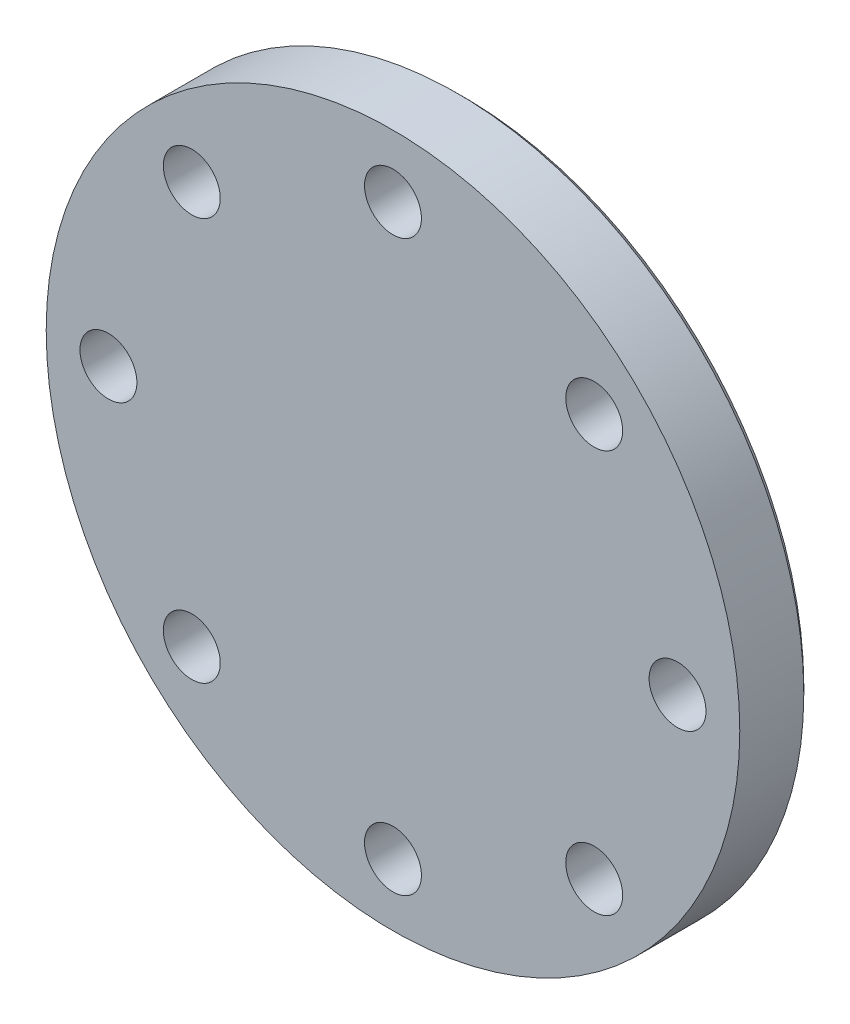
ISO-10303-21;
HEADER;
FILE_DESCRIPTION(('STEP AP214'),'2;1');
FILE_NAME('part.step','',(''),(''),'','','');
FILE_SCHEMA(('AUTOMOTIVE_DESIGN { 1 0 10303 214 1 1 1 1 }'));
ENDSEC;
DATA;
#1=APPLICATION_CONTEXT('core data for automotive mechanical design processes');
#2=APPLICATION_PROTOCOL_DEFINITION('international standard','automotive_design',2000,#1);
#3=PRODUCT_CONTEXT('',#1,'mechanical');
#4=PRODUCT('Part','Part','',(#3));
#5=PRODUCT_RELATED_PRODUCT_CATEGORY('part','',(#4));
#6=PRODUCT_DEFINITION_FORMATION('','',#4);
#7=PRODUCT_DEFINITION_CONTEXT('part definition',#1,'design');
#8=PRODUCT_DEFINITION('design','',#6,#7);
#9=PRODUCT_DEFINITION_SHAPE('','',#8);
#10=(LENGTH_UNIT() NAMED_UNIT(*) SI_UNIT(.MILLI.,.METRE.));
#11=(NAMED_UNIT(*) PLANE_ANGLE_UNIT() SI_UNIT($,.RADIAN.));
#12=(NAMED_UNIT(*) SI_UNIT($,.STERADIAN.) SOLID_ANGLE_UNIT());
#13=UNCERTAINTY_MEASURE_WITH_UNIT(LENGTH_MEASURE(1.E-05),#10,'distance_accuracy_value','');
#14=(GEOMETRIC_REPRESENTATION_CONTEXT(3) GLOBAL_UNCERTAINTY_ASSIGNED_CONTEXT((#13)) GLOBAL_UNIT_ASSIGNED_CONTEXT((#10,
#11,#12)) REPRESENTATION_CONTEXT('',''));
#15=CARTESIAN_POINT('',(0.,0.,0.));
#16=DIRECTION('',(0.,0.,1.));
#17=DIRECTION('',(1.,0.,0.));
#18=AXIS2_PLACEMENT_3D('',#15,#16,#17);
#19=CARTESIAN_POINT('',(3.5,10.85,-17.));
#20=DIRECTION('',(0.,0.,-1.));
#21=DIRECTION('',(-1.,0.,0.));
#22=AXIS2_PLACEMENT_3D('',#19,#20,#21);
#23=PLANE('',#22);
#24=CARTESIAN_POINT('',(5.656854249492,5.656854249492,-17.));
#25=DIRECTION('',(0.,0.,-1.));
#26=DIRECTION('',(-1.,0.,0.));
#27=AXIS2_PLACEMENT_3D('',#24,#25,#26);
#28=CIRCLE('',#27,0.8);
#29=CARTESIAN_POINT('',(4.856854249492,5.656854249492,-17.));
#30=VERTEX_POINT('',#29);
#31=EDGE_CURVE('E37',#30,#30,#28,.T.);
#32=ORIENTED_EDGE('',*,*,#31,.T.);
#33=EDGE_LOOP('',(#32));
#34=FACE_BOUND('',#33,.T.);
#35=CARTESIAN_POINT('',(5.656854249492,-5.656854249492,-17.));
#36=DIRECTION('',(0.,0.,-1.));
#37=DIRECTION('',(-1.,0.,0.));
#38=AXIS2_PLACEMENT_3D('',#35,#36,#37);
#39=CIRCLE('',#38,0.8);
#40=CARTESIAN_POINT('',(4.856854249492,-5.656854249492,-17.));
#41=VERTEX_POINT('',#40);
#42=EDGE_CURVE('E123',#41,#41,#39,.T.);
#43=ORIENTED_EDGE('',*,*,#42,.T.);
#44=EDGE_LOOP('',(#43));
#45=FACE_BOUND('',#44,.T.);
#46=CARTESIAN_POINT('',(-5.656854249492,-5.656854249492,-17.));
#47=DIRECTION('',(0.,0.,-1.));
#48=DIRECTION('',(-1.,0.,0.));
#49=AXIS2_PLACEMENT_3D('',#46,#47,#48);
#50=CIRCLE('',#49,0.8);
#51=CARTESIAN_POINT('',(-6.456854249492,-5.656854249492,-17.));
#52=VERTEX_POINT('',#51);
#53=EDGE_CURVE('E117',#52,#52,#50,.T.);
#54=ORIENTED_EDGE('',*,*,#53,.T.);
#55=EDGE_LOOP('',(#54));
#56=FACE_BOUND('',#55,.T.);
#57=CARTESIAN_POINT('',(-5.656854249492,5.656854249492,-17.));
#58=DIRECTION('',(0.,0.,-1.));
#59=DIRECTION('',(-1.,0.,0.));
#60=AXIS2_PLACEMENT_3D('',#57,#58,#59);
#61=CIRCLE('',#60,0.8);
#62=CARTESIAN_POINT('',(-6.456854249492,5.656854249492,-17.));
#63=VERTEX_POINT('',#62);
#64=EDGE_CURVE('E49',#63,#63,#61,.T.);
#65=ORIENTED_EDGE('',*,*,#64,.T.);
#66=EDGE_LOOP('',(#65));
#67=FACE_BOUND('',#66,.T.);
#68=CARTESIAN_POINT('',(0.,0.,-17.));
#69=DIRECTION('',(0.,0.,-1.));
#70=DIRECTION('',(-1.,0.,0.));
#71=AXIS2_PLACEMENT_3D('',#68,#69,#70);
#72=CIRCLE('',#71,9.75);
#73=CARTESIAN_POINT('',(-9.75,0.,-17.));
#74=VERTEX_POINT('',#73);
#75=EDGE_CURVE('E46',#74,#74,#72,.T.);
#76=ORIENTED_EDGE('',*,*,#75,.F.);
#77=EDGE_LOOP('',(#76));
#78=FACE_BOUND('',#77,.T.);
#79=CARTESIAN_POINT('',(-8.,0.,-17.));
#80=DIRECTION('',(0.,0.,-1.));
#81=DIRECTION('',(-1.,0.,0.));
#82=AXIS2_PLACEMENT_3D('',#79,#80,#81);
#83=CIRCLE('',#82,0.8);
#84=CARTESIAN_POINT('',(-8.8,0.,-17.));
#85=VERTEX_POINT('',#84);
#86=EDGE_CURVE('E114',#85,#85,#83,.T.);
#87=ORIENTED_EDGE('',*,*,#86,.T.);
#88=EDGE_LOOP('',(#87));
#89=FACE_BOUND('',#88,.T.);
#90=CARTESIAN_POINT('',(0.,-8.,-17.));
#91=DIRECTION('',(0.,0.,-1.));
#92=DIRECTION('',(-1.,0.,0.));
#93=AXIS2_PLACEMENT_3D('',#90,#91,#92);
#94=CIRCLE('',#93,0.8);
#95=CARTESIAN_POINT('',(-0.8,-8.,-17.));
#96=VERTEX_POINT('',#95);
#97=EDGE_CURVE('E120',#96,#96,#94,.T.);
#98=ORIENTED_EDGE('',*,*,#97,.T.);
#99=EDGE_LOOP('',(#98));
#100=FACE_BOUND('',#99,.T.);
#101=CARTESIAN_POINT('',(8.,0.,-17.));
#102=DIRECTION('',(0.,0.,-1.));
#103=DIRECTION('',(-1.,0.,0.));
#104=AXIS2_PLACEMENT_3D('',#101,#102,#103);
#105=CIRCLE('',#104,0.8);
#106=CARTESIAN_POINT('',(7.2,0.,-17.));
#107=VERTEX_POINT('',#106);
#108=EDGE_CURVE('E42',#107,#107,#105,.T.);
#109=ORIENTED_EDGE('',*,*,#108,.T.);
#110=EDGE_LOOP('',(#109));
#111=FACE_BOUND('',#110,.T.);
#112=CARTESIAN_POINT('',(0.,8.,-17.));
#113=DIRECTION('',(0.,0.,-1.));
#114=DIRECTION('',(-1.,0.,0.));
#115=AXIS2_PLACEMENT_3D('',#112,#113,#114);
#116=CIRCLE('',#115,0.8);
#117=CARTESIAN_POINT('',(-0.8,8.,-17.));
#118=VERTEX_POINT('',#117);
#119=EDGE_CURVE('E10',#118,#118,#116,.T.);
#120=ORIENTED_EDGE('',*,*,#119,.T.);
#121=EDGE_LOOP('',(#120));
#122=FACE_BOUND('',#121,.T.);
#123=ADVANCED_FACE('F30',(#34,#45,#56,#67,#78,#89,#100,#111,#122),#23,.F.);
#124=CARTESIAN_POINT('',(0.,0.,-18.5));
#125=DIRECTION('',(0.,0.,-1.));
#126=DIRECTION('',(-1.,0.,0.));
#127=AXIS2_PLACEMENT_3D('',#124,#125,#126);
#128=PLANE('',#127);
#129=CARTESIAN_POINT('',(0.,0.,-18.5));
#130=DIRECTION('',(0.,0.,-1.));
#131=DIRECTION('',(-1.,0.,0.));
#132=AXIS2_PLACEMENT_3D('',#129,#130,#131);
#133=CIRCLE('',#132,6.1);
#134=CARTESIAN_POINT('',(-6.1,0.,-18.5));
#135=VERTEX_POINT('',#134);
#136=EDGE_CURVE('E33',#135,#135,#133,.T.);
#137=ORIENTED_EDGE('',*,*,#136,.T.);
#138=EDGE_LOOP('',(#137));
#139=FACE_BOUND('',#138,.T.);
#140=ADVANCED_FACE('F166',(#139),#128,.T.);
#141=CARTESIAN_POINT('',(0.,0.,-19.));
#142=DIRECTION('',(0.,0.,-1.));
#143=DIRECTION('',(-1.,0.,0.));
#144=AXIS2_PLACEMENT_3D('',#141,#142,#143);
#145=CYLINDRICAL_SURFACE('',#144,6.1);
#146=ORIENTED_EDGE('',*,*,#136,.F.);
#147=EDGE_LOOP('',(#146));
#148=FACE_BOUND('',#147,.T.);
#149=CARTESIAN_POINT('',(0.,0.,-19.));
#150=DIRECTION('',(0.,0.,-1.));
#151=DIRECTION('',(-1.,0.,0.));
#152=AXIS2_PLACEMENT_3D('',#149,#150,#151);
#153=CIRCLE('',#152,6.1);
#154=CARTESIAN_POINT('',(-6.1,0.,-19.));
#155=VERTEX_POINT('',#154);
#156=EDGE_CURVE('E54',#155,#155,#153,.F.);
#157=ORIENTED_EDGE('',*,*,#156,.F.);
#158=EDGE_LOOP('',(#157));
#159=FACE_BOUND('',#158,.T.);
#160=ADVANCED_FACE('F147',(#148,#159),#145,.F.);
#161=CARTESIAN_POINT('',(0.,0.,-19.));
#162=DIRECTION('',(0.,0.,-1.));
#163=DIRECTION('',(-1.,0.,0.));
#164=AXIS2_PLACEMENT_3D('',#161,#162,#163);
#165=PLANE('',#164);
#166=ORIENTED_EDGE('',*,*,#156,.T.);
#167=EDGE_LOOP('',(#166));
#168=FACE_BOUND('',#167,.T.);
#169=CARTESIAN_POINT('',(-5.656854249492,5.656854249492,-18.9999999999486));
#170=DIRECTION('',(0.,0.,-1.));
#171=DIRECTION('',(-1.,0.,0.));
#172=AXIS2_PLACEMENT_3D('',#169,#170,#171);
#173=CIRCLE('',#172,1.09999999998456);
#174=CARTESIAN_POINT('',(-6.75685424947656,5.656854249492,-18.9999999999486));
#175=VERTEX_POINT('',#174);
#176=EDGE_CURVE('E57',#175,#175,#173,.F.);
#177=ORIENTED_EDGE('',*,*,#176,.T.);
#178=EDGE_LOOP('',(#177));
#179=FACE_BOUND('',#178,.T.);
#180=CARTESIAN_POINT('',(-8.,0.,-19.0000000000055));
#181=DIRECTION('',(0.,0.,-1.));
#182=DIRECTION('',(-1.,0.,0.));
#183=AXIS2_PLACEMENT_3D('',#180,#181,#182);
#184=CIRCLE('',#183,1.10000000000809);
#185=CARTESIAN_POINT('',(-9.10000000000809,0.,-19.0000000000055));
#186=VERTEX_POINT('',#185);
#187=EDGE_CURVE('E60',#186,#186,#184,.F.);
#188=ORIENTED_EDGE('',*,*,#187,.T.);
#189=EDGE_LOOP('',(#188));
#190=FACE_BOUND('',#189,.T.);
#191=CARTESIAN_POINT('',(-5.656854249492,-5.656854249492,-18.9999999999486));
#192=DIRECTION('',(0.,0.,-1.));
#193=DIRECTION('',(-1.,0.,0.));
#194=AXIS2_PLACEMENT_3D('',#191,#192,#193);
#195=CIRCLE('',#194,1.09999999998456);
#196=CARTESIAN_POINT('',(-6.75685424947656,-5.656854249492,-18.9999999999486));
#197=VERTEX_POINT('',#196);
#198=EDGE_CURVE('E63',#197,#197,#195,.F.);
#199=ORIENTED_EDGE('',*,*,#198,.T.);
#200=EDGE_LOOP('',(#199));
#201=FACE_BOUND('',#200,.T.);
#202=CARTESIAN_POINT('',(0.,-8.,-19.0000000000055));
#203=DIRECTION('',(0.,0.,-1.));
#204=DIRECTION('',(-1.,0.,0.));
#205=AXIS2_PLACEMENT_3D('',#202,#203,#204);
#206=CIRCLE('',#205,1.10000000000809);
#207=CARTESIAN_POINT('',(-1.10000000000809,-8.,-19.0000000000055));
#208=VERTEX_POINT('',#207);
#209=EDGE_CURVE('E66',#208,#208,#206,.F.);
#210=ORIENTED_EDGE('',*,*,#209,.T.);
#211=EDGE_LOOP('',(#210));
#212=FACE_BOUND('',#211,.T.);
#213=CARTESIAN_POINT('',(5.656854249492,-5.656854249492,-18.9999999999486));
#214=DIRECTION('',(0.,0.,-1.));
#215=DIRECTION('',(-1.,0.,0.));
#216=AXIS2_PLACEMENT_3D('',#213,#214,#215);
#217=CIRCLE('',#216,1.09999999998456);
#218=CARTESIAN_POINT('',(4.55685424950744,-5.656854249492,-18.9999999999486));
#219=VERTEX_POINT('',#218);
#220=EDGE_CURVE('E69',#219,#219,#217,.F.);
#221=ORIENTED_EDGE('',*,*,#220,.T.);
#222=EDGE_LOOP('',(#221));
#223=FACE_BOUND('',#222,.T.);
#224=CARTESIAN_POINT('',(8.,0.,-19.0000000000055));
#225=DIRECTION('',(0.,0.,-1.));
#226=DIRECTION('',(-1.,0.,0.));
#227=AXIS2_PLACEMENT_3D('',#224,#225,#226);
#228=CIRCLE('',#227,1.10000000000809);
#229=CARTESIAN_POINT('',(6.89999999999191,0.,-19.0000000000055));
#230=VERTEX_POINT('',#229);
#231=EDGE_CURVE('E72',#230,#230,#228,.F.);
#232=ORIENTED_EDGE('',*,*,#231,.T.);
#233=EDGE_LOOP('',(#232));
#234=FACE_BOUND('',#233,.T.);
#235=CARTESIAN_POINT('',(5.656854249492,5.656854249492,-18.9999999999486));
#236=DIRECTION('',(0.,0.,-1.));
#237=DIRECTION('',(-1.,0.,0.));
#238=AXIS2_PLACEMENT_3D('',#235,#236,#237);
#239=CIRCLE('',#238,1.09999999998456);
#240=CARTESIAN_POINT('',(4.55685424950744,5.656854249492,-18.9999999999486));
#241=VERTEX_POINT('',#240);
#242=EDGE_CURVE('E75',#241,#241,#239,.F.);
#243=ORIENTED_EDGE('',*,*,#242,.T.);
#244=EDGE_LOOP('',(#243));
#245=FACE_BOUND('',#244,.T.);
#246=CARTESIAN_POINT('',(0.,8.,-19.0000000000055));
#247=DIRECTION('',(0.,0.,-1.));
#248=DIRECTION('',(-1.,0.,0.));
#249=AXIS2_PLACEMENT_3D('',#246,#247,#248);
#250=CIRCLE('',#249,1.10000000000809);
#251=CARTESIAN_POINT('',(-1.10000000000809,8.,-19.0000000000055));
#252=VERTEX_POINT('',#251);
#253=EDGE_CURVE('E77',#252,#252,#250,.F.);
#254=ORIENTED_EDGE('',*,*,#253,.T.);
#255=EDGE_LOOP('',(#254));
#256=FACE_BOUND('',#255,.T.);
#257=CARTESIAN_POINT('',(0.,0.,-18.999999999998));
#258=DIRECTION('',(0.,0.,1.));
#259=DIRECTION('',(1.,0.,0.));
#260=AXIS2_PLACEMENT_3D('',#257,#258,#259);
#261=CIRCLE('',#260,9.54999999999802);
#262=CARTESIAN_POINT('',(9.54999999999802,0.,-18.999999999998));
#263=VERTEX_POINT('',#262);
#264=EDGE_CURVE('E51',#263,#263,#261,.T.);
#265=ORIENTED_EDGE('',*,*,#264,.F.);
#266=EDGE_LOOP('',(#265));
#267=FACE_BOUND('',#266,.T.);
#268=ADVANCED_FACE('F143',(#168,#179,#190,#201,#212,#223,#234,#245,#256,#267),#165,.T.);
#269=CARTESIAN_POINT('',(0.,0.,-18.799999999998));
#270=DIRECTION('',(0.,0.,1.));
#271=DIRECTION('',(1.,0.,0.));
#272=AXIS2_PLACEMENT_3D('',#269,#270,#271);
#273=CONICAL_SURFACE('',#272,9.74999999999799,0.785398163397301);
#274=CARTESIAN_POINT('',(0.,0.,-18.8));
#275=DIRECTION('',(0.,0.,-1.));
#276=DIRECTION('',(-1.,0.,0.));
#277=AXIS2_PLACEMENT_3D('',#274,#275,#276);
#278=CIRCLE('',#277,9.75);
#279=CARTESIAN_POINT('',(-9.75,0.,-18.8));
#280=VERTEX_POINT('',#279);
#281=EDGE_CURVE('E50',#280,#280,#278,.F.);
#282=ORIENTED_EDGE('',*,*,#281,.F.);
#283=EDGE_LOOP('',(#282));
#284=FACE_BOUND('',#283,.T.);
#285=ORIENTED_EDGE('',*,*,#264,.T.);
#286=EDGE_LOOP('',(#285));
#287=FACE_BOUND('',#286,.T.);
#288=ADVANCED_FACE('F146',(#284,#287),#273,.T.);
#289=CARTESIAN_POINT('',(0.,0.,-16.));
#290=DIRECTION('',(0.,0.,-1.));
#291=DIRECTION('',(-1.,0.,0.));
#292=AXIS2_PLACEMENT_3D('',#289,#290,#291);
#293=CYLINDRICAL_SURFACE('',#292,9.75);
#294=ORIENTED_EDGE('',*,*,#75,.T.);
#295=EDGE_LOOP('',(#294));
#296=FACE_BOUND('',#295,.T.);
#297=ORIENTED_EDGE('',*,*,#281,.T.);
#298=EDGE_LOOP('',(#297));
#299=FACE_BOUND('',#298,.T.);
#300=ADVANCED_FACE('F155',(#296,#299),#293,.T.);
#301=CARTESIAN_POINT('',(-5.656854249492,5.656854249492,-18.9999999999486));
#302=DIRECTION('',(0.,0.,-1.));
#303=DIRECTION('',(-1.,0.,0.));
#304=AXIS2_PLACEMENT_3D('',#301,#302,#303);
#305=CONICAL_SURFACE('',#304,1.09999999998456,0.78539816337857);
#306=CARTESIAN_POINT('',(-5.656854249492,5.656854249492,-18.6999999999671));
#307=DIRECTION('',(0.,0.,-1.));
#308=DIRECTION('',(0.707106781165836,0.707106781207259,0.));
#309=AXIS2_PLACEMENT_3D('',#306,#307,#308);
#310=CIRCLE('',#309,0.800000000014348);
#311=CARTESIAN_POINT('',(-5.09116882454919,6.22253967446795,-18.6999999999671));
#312=VERTEX_POINT('',#311);
#313=EDGE_CURVE('E82',#312,#312,#310,.T.);
#314=ORIENTED_EDGE('',*,*,#313,.F.);
#315=EDGE_LOOP('',(#314));
#316=FACE_BOUND('',#315,.T.);
#317=ORIENTED_EDGE('',*,*,#176,.F.);
#318=EDGE_LOOP('',(#317));
#319=FACE_BOUND('',#318,.T.);
#320=ADVANCED_FACE('F161',(#316,#319),#305,.F.);
#321=CARTESIAN_POINT('',(-5.656854249492,5.656854249492,-16.39527708002));
#322=DIRECTION('',(0.,0.,-1.));
#323=DIRECTION('',(-1.,0.,0.));
#324=AXIS2_PLACEMENT_3D('',#321,#322,#323);
#325=CYLINDRICAL_SURFACE('',#324,0.8);
#326=ORIENTED_EDGE('',*,*,#64,.F.);
#327=EDGE_LOOP('',(#326));
#328=FACE_BOUND('',#327,.T.);
#329=ORIENTED_EDGE('',*,*,#313,.T.);
#330=EDGE_LOOP('',(#329));
#331=FACE_BOUND('',#330,.T.);
#332=ADVANCED_FACE('F223',(#328,#331),#325,.F.);
#333=CARTESIAN_POINT('',(-8.,0.,-18.9999999999486));
#334=DIRECTION('',(0.,0.,-1.));
#335=DIRECTION('',(-1.,0.,0.));
#336=AXIS2_PLACEMENT_3D('',#333,#334,#335);
#337=CONICAL_SURFACE('',#336,1.09999999995125,0.785398163397448);
#338=CARTESIAN_POINT('',(-8.,0.,-18.6999999999671));
#339=DIRECTION('',(0.,0.,-1.));
#340=DIRECTION('',(0.,1.,0.));
#341=AXIS2_PLACEMENT_3D('',#338,#339,#340);
#342=CIRCLE('',#341,0.799999999969714);
#343=CARTESIAN_POINT('',(-8.,0.799999999969714,-18.6999999999671));
#344=VERTEX_POINT('',#343);
#345=EDGE_CURVE('E86',#344,#344,#342,.T.);
#346=ORIENTED_EDGE('',*,*,#345,.F.);
#347=EDGE_LOOP('',(#346));
#348=FACE_BOUND('',#347,.T.);
#349=ORIENTED_EDGE('',*,*,#187,.F.);
#350=EDGE_LOOP('',(#349));
#351=FACE_BOUND('',#350,.T.);
#352=ADVANCED_FACE('F226',(#348,#351),#337,.F.);
#353=CARTESIAN_POINT('',(-8.,0.,-16.39527708002));
#354=DIRECTION('',(0.,0.,-1.));
#355=DIRECTION('',(-1.,0.,0.));
#356=AXIS2_PLACEMENT_3D('',#353,#354,#355);
#357=CYLINDRICAL_SURFACE('',#356,0.8);
#358=ORIENTED_EDGE('',*,*,#86,.F.);
#359=EDGE_LOOP('',(#358));
#360=FACE_BOUND('',#359,.T.);
#361=ORIENTED_EDGE('',*,*,#345,.T.);
#362=EDGE_LOOP('',(#361));
#363=FACE_BOUND('',#362,.T.);
#364=ADVANCED_FACE('F228',(#360,#363),#357,.F.);
#365=CARTESIAN_POINT('',(-5.656854249492,-5.656854249492,-18.9999999999486));
#366=DIRECTION('',(0.,0.,-1.));
#367=DIRECTION('',(-1.,0.,0.));
#368=AXIS2_PLACEMENT_3D('',#365,#366,#367);
#369=CONICAL_SURFACE('',#368,1.09999999998456,0.78539816337857);
#370=CARTESIAN_POINT('',(-5.656854249492,-5.656854249492,-18.6999999999671));
#371=DIRECTION('',(0.,0.,-1.));
#372=DIRECTION('',(-0.707106781207259,0.707106781165836,0.));
#373=AXIS2_PLACEMENT_3D('',#370,#371,#372);
#374=CIRCLE('',#373,0.800000000014348);
#375=CARTESIAN_POINT('',(-6.22253967446795,-5.09116882454919,-18.6999999999671));
#376=VERTEX_POINT('',#375);
#377=EDGE_CURVE('E91',#376,#376,#374,.T.);
#378=ORIENTED_EDGE('',*,*,#377,.F.);
#379=EDGE_LOOP('',(#378));
#380=FACE_BOUND('',#379,.T.);
#381=ORIENTED_EDGE('',*,*,#198,.F.);
#382=EDGE_LOOP('',(#381));
#383=FACE_BOUND('',#382,.T.);
#384=ADVANCED_FACE('F231',(#380,#383),#369,.F.);
#385=CARTESIAN_POINT('',(-5.656854249492,-5.656854249492,-16.39527708002));
#386=DIRECTION('',(0.,0.,-1.));
#387=DIRECTION('',(-1.,0.,0.));
#388=AXIS2_PLACEMENT_3D('',#385,#386,#387);
#389=CYLINDRICAL_SURFACE('',#388,0.8);
#390=ORIENTED_EDGE('',*,*,#53,.F.);
#391=EDGE_LOOP('',(#390));
#392=FACE_BOUND('',#391,.T.);
#393=ORIENTED_EDGE('',*,*,#377,.T.);
#394=EDGE_LOOP('',(#393));
#395=FACE_BOUND('',#394,.T.);
#396=ADVANCED_FACE('F196',(#392,#395),#389,.F.);
#397=CARTESIAN_POINT('',(0.,-8.,-18.9999999999486));
#398=DIRECTION('',(0.,0.,-1.));
#399=DIRECTION('',(-1.,0.,0.));
#400=AXIS2_PLACEMENT_3D('',#397,#398,#399);
#401=CONICAL_SURFACE('',#400,1.09999999995125,0.785398163397448);
#402=CARTESIAN_POINT('',(0.,-8.,-18.6999999999671));
#403=DIRECTION('',(0.,0.,-1.));
#404=DIRECTION('',(-1.,0.,0.));
#405=AXIS2_PLACEMENT_3D('',#402,#403,#404);
#406=CIRCLE('',#405,0.799999999969714);
#407=CARTESIAN_POINT('',(-0.799999999969714,-8.,-18.6999999999671));
#408=VERTEX_POINT('',#407);
#409=EDGE_CURVE('E97',#408,#408,#406,.T.);
#410=ORIENTED_EDGE('',*,*,#409,.F.);
#411=EDGE_LOOP('',(#410));
#412=FACE_BOUND('',#411,.T.);
#413=ORIENTED_EDGE('',*,*,#209,.F.);
#414=EDGE_LOOP('',(#413));
#415=FACE_BOUND('',#414,.T.);
#416=ADVANCED_FACE('F190',(#412,#415),#401,.F.);
#417=CARTESIAN_POINT('',(0.,-8.,-16.39527708002));
#418=DIRECTION('',(0.,0.,-1.));
#419=DIRECTION('',(-1.,0.,0.));
#420=AXIS2_PLACEMENT_3D('',#417,#418,#419);
#421=CYLINDRICAL_SURFACE('',#420,0.8);
#422=ORIENTED_EDGE('',*,*,#97,.F.);
#423=EDGE_LOOP('',(#422));
#424=FACE_BOUND('',#423,.T.);
#425=ORIENTED_EDGE('',*,*,#409,.T.);
#426=EDGE_LOOP('',(#425));
#427=FACE_BOUND('',#426,.T.);
#428=ADVANCED_FACE('F186',(#424,#427),#421,.F.);
#429=CARTESIAN_POINT('',(5.656854249492,-5.656854249492,-18.9999999999486));
#430=DIRECTION('',(0.,0.,-1.));
#431=DIRECTION('',(-1.,0.,0.));
#432=AXIS2_PLACEMENT_3D('',#429,#430,#431);
#433=CONICAL_SURFACE('',#432,1.09999999998456,0.78539816337857);
#434=CARTESIAN_POINT('',(5.656854249492,-5.656854249492,-18.6999999999671));
#435=DIRECTION('',(0.,0.,-1.));
#436=DIRECTION('',(-0.707106781165836,-0.707106781207259,0.));
#437=AXIS2_PLACEMENT_3D('',#434,#435,#436);
#438=CIRCLE('',#437,0.800000000014348);
#439=CARTESIAN_POINT('',(5.09116882454919,-6.22253967446795,-18.6999999999671));
#440=VERTEX_POINT('',#439);
#441=EDGE_CURVE('E100',#440,#440,#438,.T.);
#442=ORIENTED_EDGE('',*,*,#441,.F.);
#443=EDGE_LOOP('',(#442));
#444=FACE_BOUND('',#443,.T.);
#445=ORIENTED_EDGE('',*,*,#220,.F.);
#446=EDGE_LOOP('',(#445));
#447=FACE_BOUND('',#446,.T.);
#448=ADVANCED_FACE('F189',(#444,#447),#433,.F.);
#449=CARTESIAN_POINT('',(5.656854249492,-5.656854249492,-16.39527708002));
#450=DIRECTION('',(0.,0.,-1.));
#451=DIRECTION('',(-1.,0.,0.));
#452=AXIS2_PLACEMENT_3D('',#449,#450,#451);
#453=CYLINDRICAL_SURFACE('',#452,0.8);
#454=ORIENTED_EDGE('',*,*,#42,.F.);
#455=EDGE_LOOP('',(#454));
#456=FACE_BOUND('',#455,.T.);
#457=ORIENTED_EDGE('',*,*,#441,.T.);
#458=EDGE_LOOP('',(#457));
#459=FACE_BOUND('',#458,.T.);
#460=ADVANCED_FACE('F139',(#456,#459),#453,.F.);
#461=CARTESIAN_POINT('',(8.,0.,-18.9999999999486));
#462=DIRECTION('',(0.,0.,-1.));
#463=DIRECTION('',(-1.,0.,0.));
#464=AXIS2_PLACEMENT_3D('',#461,#462,#463);
#465=CONICAL_SURFACE('',#464,1.09999999995125,0.785398163397448);
#466=CARTESIAN_POINT('',(8.,0.,-18.6999999999671));
#467=DIRECTION('',(0.,0.,-1.));
#468=DIRECTION('',(0.,-1.,0.));
#469=AXIS2_PLACEMENT_3D('',#466,#467,#468);
#470=CIRCLE('',#469,0.799999999969714);
#471=CARTESIAN_POINT('',(8.,-0.799999999969714,-18.6999999999671));
#472=VERTEX_POINT('',#471);
#473=EDGE_CURVE('E103',#472,#472,#470,.T.);
#474=ORIENTED_EDGE('',*,*,#473,.F.);
#475=EDGE_LOOP('',(#474));
#476=FACE_BOUND('',#475,.T.);
#477=ORIENTED_EDGE('',*,*,#231,.F.);
#478=EDGE_LOOP('',(#477));
#479=FACE_BOUND('',#478,.T.);
#480=ADVANCED_FACE('F133',(#476,#479),#465,.F.);
#481=CARTESIAN_POINT('',(8.,0.,-16.39527708002));
#482=DIRECTION('',(0.,0.,-1.));
#483=DIRECTION('',(-1.,0.,0.));
#484=AXIS2_PLACEMENT_3D('',#481,#482,#483);
#485=CYLINDRICAL_SURFACE('',#484,0.8);
#486=ORIENTED_EDGE('',*,*,#108,.F.);
#487=EDGE_LOOP('',(#486));
#488=FACE_BOUND('',#487,.T.);
#489=ORIENTED_EDGE('',*,*,#473,.T.);
#490=EDGE_LOOP('',(#489));
#491=FACE_BOUND('',#490,.T.);
#492=ADVANCED_FACE('F129',(#488,#491),#485,.F.);
#493=CARTESIAN_POINT('',(5.656854249492,5.656854249492,-18.9999999999486));
#494=DIRECTION('',(0.,0.,-1.));
#495=DIRECTION('',(-1.,0.,0.));
#496=AXIS2_PLACEMENT_3D('',#493,#494,#495);
#497=CONICAL_SURFACE('',#496,1.09999999998456,0.78539816337857);
#498=CARTESIAN_POINT('',(5.656854249492,5.656854249492,-18.6999999999671));
#499=DIRECTION('',(0.,0.,-1.));
#500=DIRECTION('',(0.707106781207259,-0.707106781165836,0.));
#501=AXIS2_PLACEMENT_3D('',#498,#499,#500);
#502=CIRCLE('',#501,0.800000000014348);
#503=CARTESIAN_POINT('',(6.22253967446795,5.09116882454919,-18.6999999999671));
#504=VERTEX_POINT('',#503);
#505=EDGE_CURVE('E106',#504,#504,#502,.T.);
#506=ORIENTED_EDGE('',*,*,#505,.F.);
#507=EDGE_LOOP('',(#506));
#508=FACE_BOUND('',#507,.T.);
#509=ORIENTED_EDGE('',*,*,#242,.F.);
#510=EDGE_LOOP('',(#509));
#511=FACE_BOUND('',#510,.T.);
#512=ADVANCED_FACE('F132',(#508,#511),#497,.F.);
#513=CARTESIAN_POINT('',(5.656854249492,5.656854249492,-16.39527708002));
#514=DIRECTION('',(0.,0.,-1.));
#515=DIRECTION('',(-1.,0.,0.));
#516=AXIS2_PLACEMENT_3D('',#513,#514,#515);
#517=CYLINDRICAL_SURFACE('',#516,0.8);
#518=ORIENTED_EDGE('',*,*,#31,.F.);
#519=EDGE_LOOP('',(#518));
#520=FACE_BOUND('',#519,.T.);
#521=ORIENTED_EDGE('',*,*,#505,.T.);
#522=EDGE_LOOP('',(#521));
#523=FACE_BOUND('',#522,.T.);
#524=ADVANCED_FACE('F216',(#520,#523),#517,.F.);
#525=CARTESIAN_POINT('',(0.,8.,-18.9999999999486));
#526=DIRECTION('',(0.,0.,-1.));
#527=DIRECTION('',(-1.,0.,0.));
#528=AXIS2_PLACEMENT_3D('',#525,#526,#527);
#529=CONICAL_SURFACE('',#528,1.09999999995125,0.785398163397448);
#530=CARTESIAN_POINT('',(0.,8.,-18.6999999999671));
#531=DIRECTION('',(0.,0.,-1.));
#532=DIRECTION('',(1.,0.,0.));
#533=AXIS2_PLACEMENT_3D('',#530,#531,#532);
#534=CIRCLE('',#533,0.799999999969714);
#535=CARTESIAN_POINT('',(0.799999999969714,8.,-18.6999999999671));
#536=VERTEX_POINT('',#535);
#537=EDGE_CURVE('E109',#536,#536,#534,.T.);
#538=ORIENTED_EDGE('',*,*,#537,.F.);
#539=EDGE_LOOP('',(#538));
#540=FACE_BOUND('',#539,.T.);
#541=ORIENTED_EDGE('',*,*,#253,.F.);
#542=EDGE_LOOP('',(#541));
#543=FACE_BOUND('',#542,.T.);
#544=ADVANCED_FACE('F218',(#540,#543),#529,.F.);
#545=CARTESIAN_POINT('',(0.,8.,-16.39527708002));
#546=DIRECTION('',(0.,0.,-1.));
#547=DIRECTION('',(-1.,0.,0.));
#548=AXIS2_PLACEMENT_3D('',#545,#546,#547);
#549=CYLINDRICAL_SURFACE('',#548,0.8);
#550=ORIENTED_EDGE('',*,*,#119,.F.);
#551=EDGE_LOOP('',(#550));
#552=FACE_BOUND('',#551,.T.);
#553=ORIENTED_EDGE('',*,*,#537,.T.);
#554=EDGE_LOOP('',(#553));
#555=FACE_BOUND('',#554,.T.);
#556=ADVANCED_FACE('F220',(#552,#555),#549,.F.);
#557=CLOSED_SHELL('',(#123,#140,#160,#268,#288,#300,#320,#332,#352,#364,#384,#396,#416,#428,
#448,#460,#480,#492,#512,#524,#544,#556));
#558=MANIFOLD_SOLID_BREP('B2',#557);
#559=ADVANCED_BREP_SHAPE_REPRESENTATION('',(#18,#558),#14);
#560=SHAPE_DEFINITION_REPRESENTATION(#9,#559);
ENDSEC;
END-ISO-10303-21;
